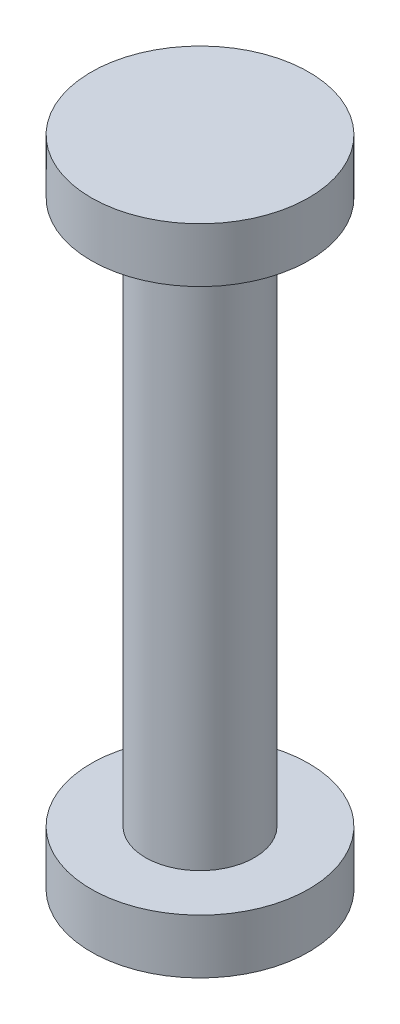
ISO-10303-21;
HEADER;
FILE_DESCRIPTION(('STEP AP214'),'2;1');
FILE_NAME('part.step','',(''),(''),'','','');
FILE_SCHEMA(('AUTOMOTIVE_DESIGN { 1 0 10303 214 1 1 1 1 }'));
ENDSEC;
DATA;
#1=APPLICATION_CONTEXT('core data for automotive mechanical design processes');
#2=APPLICATION_PROTOCOL_DEFINITION('international standard','automotive_design',2000,#1);
#3=PRODUCT_CONTEXT('',#1,'mechanical');
#4=PRODUCT('Part','Part','',(#3));
#5=PRODUCT_RELATED_PRODUCT_CATEGORY('part','',(#4));
#6=PRODUCT_DEFINITION_FORMATION('','',#4);
#7=PRODUCT_DEFINITION_CONTEXT('part definition',#1,'design');
#8=PRODUCT_DEFINITION('design','',#6,#7);
#9=PRODUCT_DEFINITION_SHAPE('','',#8);
#10=(LENGTH_UNIT() NAMED_UNIT(*) SI_UNIT(.MILLI.,.METRE.));
#11=(NAMED_UNIT(*) PLANE_ANGLE_UNIT() SI_UNIT($,.RADIAN.));
#12=(NAMED_UNIT(*) SI_UNIT($,.STERADIAN.) SOLID_ANGLE_UNIT());
#13=UNCERTAINTY_MEASURE_WITH_UNIT(LENGTH_MEASURE(1.E-05),#10,'distance_accuracy_value','');
#14=(GEOMETRIC_REPRESENTATION_CONTEXT(3) GLOBAL_UNCERTAINTY_ASSIGNED_CONTEXT((#13)) GLOBAL_UNIT_ASSIGNED_CONTEXT((#10,
#11,#12)) REPRESENTATION_CONTEXT('',''));
#15=CARTESIAN_POINT('',(0.,0.,0.));
#16=DIRECTION('',(0.,0.,1.));
#17=DIRECTION('',(1.,0.,0.));
#18=AXIS2_PLACEMENT_3D('',#15,#16,#17);
#19=CARTESIAN_POINT('',(0.,50.,0.));
#20=DIRECTION('',(0.,-1.,0.));
#21=DIRECTION('',(0.,0.,-1.));
#22=AXIS2_PLACEMENT_3D('',#19,#20,#21);
#23=CYLINDRICAL_SURFACE('',#22,5.);
#24=CARTESIAN_POINT('',(0.,50.,0.));
#25=DIRECTION('',(0.,1.,0.));
#26=DIRECTION('',(0.,0.,1.));
#27=AXIS2_PLACEMENT_3D('',#24,#25,#26);
#28=CIRCLE('',#27,5.);
#29=CARTESIAN_POINT('',(0.,50.,5.));
#30=VERTEX_POINT('',#29);
#31=EDGE_CURVE('E10',#30,#30,#28,.T.);
#32=ORIENTED_EDGE('',*,*,#31,.F.);
#33=EDGE_LOOP('',(#32));
#34=FACE_BOUND('',#33,.T.);
#35=CARTESIAN_POINT('',(0.,0.,0.));
#36=DIRECTION('',(0.,1.,0.));
#37=DIRECTION('',(0.,0.,1.));
#38=AXIS2_PLACEMENT_3D('',#35,#36,#37);
#39=CIRCLE('',#38,5.);
#40=CARTESIAN_POINT('',(0.,0.,5.));
#41=VERTEX_POINT('',#40);
#42=EDGE_CURVE('E40',#41,#41,#39,.T.);
#43=ORIENTED_EDGE('',*,*,#42,.T.);
#44=EDGE_LOOP('',(#43));
#45=FACE_BOUND('',#44,.T.);
#46=ADVANCED_FACE('F37',(#34,#45),#23,.T.);
#47=CARTESIAN_POINT('',(0.,55.,0.));
#48=DIRECTION('',(0.,-1.,0.));
#49=DIRECTION('',(0.,0.,-1.));
#50=AXIS2_PLACEMENT_3D('',#47,#48,#49);
#51=CYLINDRICAL_SURFACE('',#50,10.);
#52=CARTESIAN_POINT('',(0.,55.,0.));
#53=DIRECTION('',(0.,1.,0.));
#54=DIRECTION('',(0.,0.,1.));
#55=AXIS2_PLACEMENT_3D('',#52,#53,#54);
#56=CIRCLE('',#55,10.);
#57=CARTESIAN_POINT('',(0.,55.,10.));
#58=VERTEX_POINT('',#57);
#59=EDGE_CURVE('E45',#58,#58,#56,.T.);
#60=ORIENTED_EDGE('',*,*,#59,.F.);
#61=EDGE_LOOP('',(#60));
#62=FACE_BOUND('',#61,.T.);
#63=CARTESIAN_POINT('',(0.,50.,0.));
#64=DIRECTION('',(0.,1.,0.));
#65=DIRECTION('',(0.,0.,1.));
#66=AXIS2_PLACEMENT_3D('',#63,#64,#65);
#67=CIRCLE('',#66,10.);
#68=CARTESIAN_POINT('',(0.,50.,10.));
#69=VERTEX_POINT('',#68);
#70=EDGE_CURVE('E50',#69,#69,#67,.T.);
#71=ORIENTED_EDGE('',*,*,#70,.T.);
#72=EDGE_LOOP('',(#71));
#73=FACE_BOUND('',#72,.T.);
#74=ADVANCED_FACE('F91',(#62,#73),#51,.T.);
#75=CARTESIAN_POINT('',(0.,55.,0.));
#76=DIRECTION('',(0.,1.,0.));
#77=DIRECTION('',(0.,0.,1.));
#78=AXIS2_PLACEMENT_3D('',#75,#76,#77);
#79=PLANE('',#78);
#80=ORIENTED_EDGE('',*,*,#59,.T.);
#81=EDGE_LOOP('',(#80));
#82=FACE_BOUND('',#81,.T.);
#83=ADVANCED_FACE('F87',(#82),#79,.T.);
#84=CARTESIAN_POINT('',(0.,50.,0.));
#85=DIRECTION('',(0.,1.,0.));
#86=DIRECTION('',(0.,0.,1.));
#87=AXIS2_PLACEMENT_3D('',#84,#85,#86);
#88=PLANE('',#87);
#89=ORIENTED_EDGE('',*,*,#31,.T.);
#90=EDGE_LOOP('',(#89));
#91=FACE_BOUND('',#90,.T.);
#92=ORIENTED_EDGE('',*,*,#70,.F.);
#93=EDGE_LOOP('',(#92));
#94=FACE_BOUND('',#93,.T.);
#95=ADVANCED_FACE('F79',(#91,#94),#88,.F.);
#96=CARTESIAN_POINT('',(0.,-5.,0.));
#97=DIRECTION('',(0.,1.,0.));
#98=DIRECTION('',(0.,0.,1.));
#99=AXIS2_PLACEMENT_3D('',#96,#97,#98);
#100=CYLINDRICAL_SURFACE('',#99,10.);
#101=CARTESIAN_POINT('',(0.,-5.,0.));
#102=DIRECTION('',(0.,-1.,0.));
#103=DIRECTION('',(0.,0.,-1.));
#104=AXIS2_PLACEMENT_3D('',#101,#102,#103);
#105=CIRCLE('',#104,10.);
#106=CARTESIAN_POINT('',(0.,-5.,-10.));
#107=VERTEX_POINT('',#106);
#108=EDGE_CURVE('E60',#107,#107,#105,.T.);
#109=ORIENTED_EDGE('',*,*,#108,.F.);
#110=EDGE_LOOP('',(#109));
#111=FACE_BOUND('',#110,.T.);
#112=CARTESIAN_POINT('',(0.,0.,0.));
#113=DIRECTION('',(0.,-1.,0.));
#114=DIRECTION('',(0.,0.,-1.));
#115=AXIS2_PLACEMENT_3D('',#112,#113,#114);
#116=CIRCLE('',#115,10.);
#117=CARTESIAN_POINT('',(0.,0.,-10.));
#118=VERTEX_POINT('',#117);
#119=EDGE_CURVE('E56',#118,#118,#116,.T.);
#120=ORIENTED_EDGE('',*,*,#119,.T.);
#121=EDGE_LOOP('',(#120));
#122=FACE_BOUND('',#121,.T.);
#123=ADVANCED_FACE('F77',(#111,#122),#100,.T.);
#124=CARTESIAN_POINT('',(0.,-5.,0.));
#125=DIRECTION('',(0.,-1.,0.));
#126=DIRECTION('',(0.,0.,-1.));
#127=AXIS2_PLACEMENT_3D('',#124,#125,#126);
#128=PLANE('',#127);
#129=ORIENTED_EDGE('',*,*,#108,.T.);
#130=EDGE_LOOP('',(#129));
#131=FACE_BOUND('',#130,.T.);
#132=ADVANCED_FACE('F73',(#131),#128,.T.);
#133=CARTESIAN_POINT('',(0.,0.,0.));
#134=DIRECTION('',(0.,-1.,0.));
#135=DIRECTION('',(0.,0.,-1.));
#136=AXIS2_PLACEMENT_3D('',#133,#134,#135);
#137=PLANE('',#136);
#138=ORIENTED_EDGE('',*,*,#42,.F.);
#139=EDGE_LOOP('',(#138));
#140=FACE_BOUND('',#139,.T.);
#141=ORIENTED_EDGE('',*,*,#119,.F.);
#142=EDGE_LOOP('',(#141));
#143=FACE_BOUND('',#142,.T.);
#144=ADVANCED_FACE('F70',(#140,#143),#137,.F.);
#145=CLOSED_SHELL('',(#46,#74,#83,#95,#123,#132,#144));
#146=MANIFOLD_SOLID_BREP('B2',#145);
#147=ADVANCED_BREP_SHAPE_REPRESENTATION('',(#18,#146),#14);
#148=SHAPE_DEFINITION_REPRESENTATION(#9,#147);
ENDSEC;
END-ISO-10303-21;
